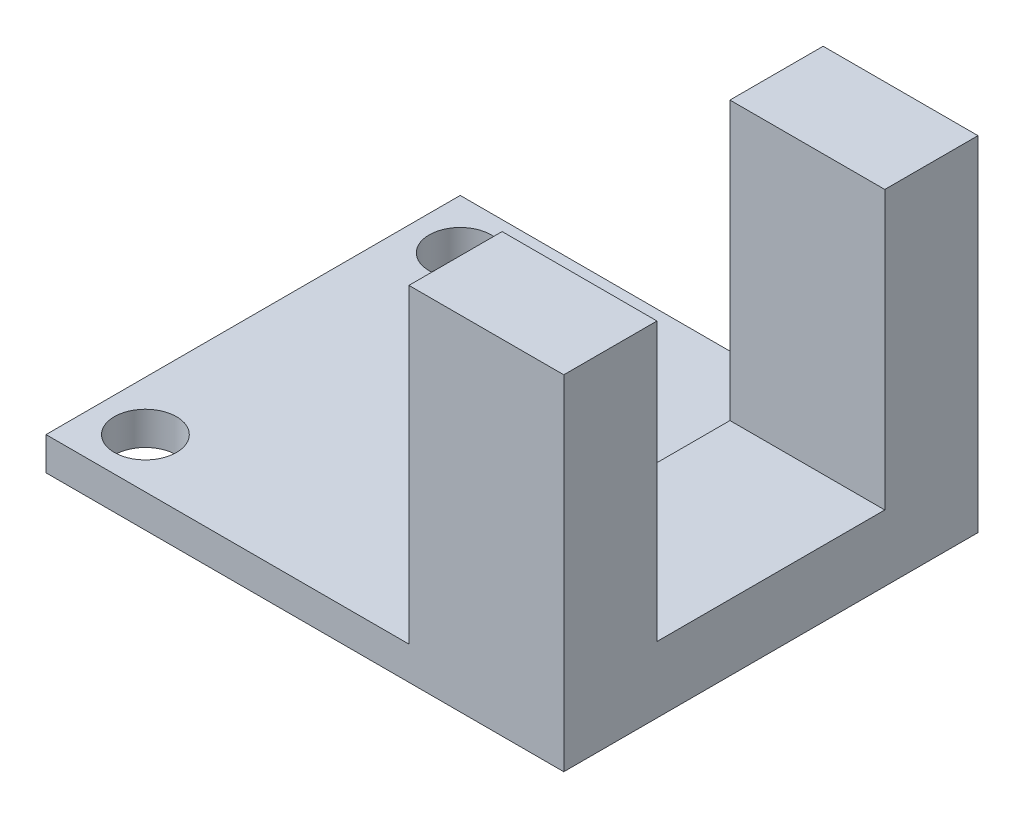
ISO-10303-21;
HEADER;
FILE_DESCRIPTION(('STEP AP214'),'2;1');
FILE_NAME('part.step','',(''),(''),'','','');
FILE_SCHEMA(('AUTOMOTIVE_DESIGN { 1 0 10303 214 1 1 1 1 }'));
ENDSEC;
DATA;
#1=APPLICATION_CONTEXT('core data for automotive mechanical design processes');
#2=APPLICATION_PROTOCOL_DEFINITION('international standard','automotive_design',2000,#1);
#3=PRODUCT_CONTEXT('',#1,'mechanical');
#4=PRODUCT('Part','Part','',(#3));
#5=PRODUCT_RELATED_PRODUCT_CATEGORY('part','',(#4));
#6=PRODUCT_DEFINITION_FORMATION('','',#4);
#7=PRODUCT_DEFINITION_CONTEXT('part definition',#1,'design');
#8=PRODUCT_DEFINITION('design','',#6,#7);
#9=PRODUCT_DEFINITION_SHAPE('','',#8);
#10=(LENGTH_UNIT() NAMED_UNIT(*) SI_UNIT(.MILLI.,.METRE.));
#11=(NAMED_UNIT(*) PLANE_ANGLE_UNIT() SI_UNIT($,.RADIAN.));
#12=(NAMED_UNIT(*) SI_UNIT($,.STERADIAN.) SOLID_ANGLE_UNIT());
#13=UNCERTAINTY_MEASURE_WITH_UNIT(LENGTH_MEASURE(1.E-05),#10,'distance_accuracy_value','');
#14=(GEOMETRIC_REPRESENTATION_CONTEXT(3) GLOBAL_UNCERTAINTY_ASSIGNED_CONTEXT((#13)) GLOBAL_UNIT_ASSIGNED_CONTEXT((#10,
#11,#12)) REPRESENTATION_CONTEXT('',''));
#15=CARTESIAN_POINT('',(0.,0.,0.));
#16=DIRECTION('',(0.,0.,1.));
#17=DIRECTION('',(1.,0.,0.));
#18=AXIS2_PLACEMENT_3D('',#15,#16,#17);
#19=CARTESIAN_POINT('',(0.,16.6,0.));
#20=DIRECTION('',(0.,-1.,0.));
#21=DIRECTION('',(0.,0.,-1.));
#22=AXIS2_PLACEMENT_3D('',#19,#20,#21);
#23=PLANE('',#22);
#24=DIRECTION('',(0.,0.,-1.));
#25=VECTOR('',#24,1.);
#26=CARTESIAN_POINT('',(12.5,16.6,-10.));
#27=LINE('',#26,#25);
#28=CARTESIAN_POINT('',(12.5,16.6,10.));
#29=VERTEX_POINT('',#28);
#30=CARTESIAN_POINT('',(12.5,16.6,5.5));
#31=VERTEX_POINT('',#30);
#32=EDGE_CURVE('E155',#29,#31,#27,.T.);
#33=ORIENTED_EDGE('',*,*,#32,.T.);
#34=DIRECTION('',(-1.,0.,0.));
#35=VECTOR('',#34,1.);
#36=CARTESIAN_POINT('',(0.,16.6,5.5));
#37=LINE('',#36,#35);
#38=CARTESIAN_POINT('',(5.02288268675244,16.6,5.5));
#39=VERTEX_POINT('',#38);
#40=EDGE_CURVE('E49',#31,#39,#37,.T.);
#41=ORIENTED_EDGE('',*,*,#40,.T.);
#42=DIRECTION('',(0.,0.,1.));
#43=VECTOR('',#42,1.);
#44=CARTESIAN_POINT('',(5.02288268675244,16.6,-10.));
#45=LINE('',#44,#43);
#46=CARTESIAN_POINT('',(5.02288268675244,16.6,10.));
#47=VERTEX_POINT('',#46);
#48=EDGE_CURVE('E162',#39,#47,#45,.T.);
#49=ORIENTED_EDGE('',*,*,#48,.T.);
#50=DIRECTION('',(1.,0.,0.));
#51=VECTOR('',#50,1.);
#52=CARTESIAN_POINT('',(12.5,16.6,10.));
#53=LINE('',#52,#51);
#54=EDGE_CURVE('E167',#47,#29,#53,.T.);
#55=ORIENTED_EDGE('',*,*,#54,.T.);
#56=EDGE_LOOP('',(#33,#41,#49,#55));
#57=FACE_BOUND('',#56,.T.);
#58=ADVANCED_FACE('F39',(#57),#23,.F.);
#59=CARTESIAN_POINT('',(12.5,1.6,-10.));
#60=DIRECTION('',(-1.,0.,0.));
#61=DIRECTION('',(0.,0.,1.));
#62=AXIS2_PLACEMENT_3D('',#59,#60,#61);
#63=PLANE('',#62);
#64=DIRECTION('',(0.,0.,-1.));
#65=VECTOR('',#64,1.);
#66=CARTESIAN_POINT('',(12.5,3.19763777042681,5.5));
#67=LINE('',#66,#65);
#68=CARTESIAN_POINT('',(12.5,3.19763777042681,5.5));
#69=VERTEX_POINT('',#68);
#70=CARTESIAN_POINT('',(12.5,3.19763777042681,-5.5));
#71=VERTEX_POINT('',#70);
#72=EDGE_CURVE('E124',#69,#71,#67,.T.);
#73=ORIENTED_EDGE('',*,*,#72,.F.);
#74=DIRECTION('',(0.,-1.,0.));
#75=VECTOR('',#74,1.);
#76=CARTESIAN_POINT('',(12.5,16.6,5.5));
#77=LINE('',#76,#75);
#78=EDGE_CURVE('E131',#31,#69,#77,.T.);
#79=ORIENTED_EDGE('',*,*,#78,.F.);
#80=ORIENTED_EDGE('',*,*,#32,.F.);
#81=DIRECTION('',(0.,-1.,0.));
#82=VECTOR('',#81,1.);
#83=CARTESIAN_POINT('',(12.5,1.6,10.));
#84=LINE('',#83,#82);
#85=CARTESIAN_POINT('',(12.5,0.,10.));
#86=VERTEX_POINT('',#85);
#87=EDGE_CURVE('E192',#29,#86,#84,.T.);
#88=ORIENTED_EDGE('',*,*,#87,.T.);
#89=DIRECTION('',(0.,0.,-1.));
#90=VECTOR('',#89,1.);
#91=CARTESIAN_POINT('',(12.5,0.,-10.));
#92=LINE('',#91,#90);
#93=CARTESIAN_POINT('',(12.5,0.,-10.));
#94=VERTEX_POINT('',#93);
#95=EDGE_CURVE('E181',#86,#94,#92,.T.);
#96=ORIENTED_EDGE('',*,*,#95,.T.);
#97=DIRECTION('',(0.,-1.,0.));
#98=VECTOR('',#97,1.);
#99=CARTESIAN_POINT('',(12.5,1.6,-10.));
#100=LINE('',#99,#98);
#101=CARTESIAN_POINT('',(12.5,16.6,-10.));
#102=VERTEX_POINT('',#101);
#103=EDGE_CURVE('E215',#102,#94,#100,.T.);
#104=ORIENTED_EDGE('',*,*,#103,.F.);
#105=CARTESIAN_POINT('',(12.5,16.6,-5.5));
#106=VERTEX_POINT('',#105);
#107=EDGE_CURVE('E159',#106,#102,#27,.T.);
#108=ORIENTED_EDGE('',*,*,#107,.F.);
#109=DIRECTION('',(0.,1.,0.));
#110=VECTOR('',#109,1.);
#111=CARTESIAN_POINT('',(12.5,16.6,-5.5));
#112=LINE('',#111,#110);
#113=EDGE_CURVE('E57',#71,#106,#112,.T.);
#114=ORIENTED_EDGE('',*,*,#113,.F.);
#115=EDGE_LOOP('',(#73,#79,#80,#88,#96,#104,#108,#114));
#116=FACE_BOUND('',#115,.T.);
#117=ADVANCED_FACE('F41',(#116),#63,.F.);
#118=CARTESIAN_POINT('',(-12.5,1.6,-10.));
#119=DIRECTION('',(0.,0.,1.));
#120=DIRECTION('',(1.,0.,0.));
#121=AXIS2_PLACEMENT_3D('',#118,#119,#120);
#122=PLANE('',#121);
#123=DIRECTION('',(-1.,0.,0.));
#124=VECTOR('',#123,1.);
#125=CARTESIAN_POINT('',(-12.5,0.,-10.));
#126=LINE('',#125,#124);
#127=CARTESIAN_POINT('',(-12.5,0.,-10.));
#128=VERTEX_POINT('',#127);
#129=EDGE_CURVE('E196',#94,#128,#126,.T.);
#130=ORIENTED_EDGE('',*,*,#129,.T.);
#131=DIRECTION('',(0.,-1.,0.));
#132=VECTOR('',#131,1.);
#133=CARTESIAN_POINT('',(-12.5,1.6,-10.));
#134=LINE('',#133,#132);
#135=CARTESIAN_POINT('',(-12.5,1.6,-10.));
#136=VERTEX_POINT('',#135);
#137=EDGE_CURVE('E211',#136,#128,#134,.T.);
#138=ORIENTED_EDGE('',*,*,#137,.F.);
#139=DIRECTION('',(-1.,0.,0.));
#140=VECTOR('',#139,1.);
#141=CARTESIAN_POINT('',(-12.5,1.6,-10.));
#142=LINE('',#141,#140);
#143=CARTESIAN_POINT('',(5.02288268675244,1.6,-10.));
#144=VERTEX_POINT('',#143);
#145=EDGE_CURVE('E182',#144,#136,#142,.T.);
#146=ORIENTED_EDGE('',*,*,#145,.F.);
#147=DIRECTION('',(0.,-1.,0.));
#148=VECTOR('',#147,1.);
#149=CARTESIAN_POINT('',(5.02288268675244,16.6,-10.));
#150=LINE('',#149,#148);
#151=CARTESIAN_POINT('',(5.02288268675244,16.6,-10.));
#152=VERTEX_POINT('',#151);
#153=EDGE_CURVE('E177',#152,#144,#150,.T.);
#154=ORIENTED_EDGE('',*,*,#153,.F.);
#155=DIRECTION('',(-1.,0.,0.));
#156=VECTOR('',#155,1.);
#157=CARTESIAN_POINT('',(12.5,16.6,-10.));
#158=LINE('',#157,#156);
#159=EDGE_CURVE('E158',#102,#152,#158,.T.);
#160=ORIENTED_EDGE('',*,*,#159,.F.);
#161=ORIENTED_EDGE('',*,*,#103,.T.);
#162=EDGE_LOOP('',(#130,#138,#146,#154,#160,#161));
#163=FACE_BOUND('',#162,.T.);
#164=ADVANCED_FACE('F268',(#163),#122,.F.);
#165=CARTESIAN_POINT('',(-12.5,1.6,-10.));
#166=DIRECTION('',(1.,0.,0.));
#167=DIRECTION('',(0.,0.,-1.));
#168=AXIS2_PLACEMENT_3D('',#165,#166,#167);
#169=PLANE('',#168);
#170=DIRECTION('',(0.,0.,1.));
#171=VECTOR('',#170,1.);
#172=CARTESIAN_POINT('',(-12.5,0.,-10.));
#173=LINE('',#172,#171);
#174=CARTESIAN_POINT('',(-12.5,0.,10.));
#175=VERTEX_POINT('',#174);
#176=EDGE_CURVE('E199',#128,#175,#173,.T.);
#177=ORIENTED_EDGE('',*,*,#176,.T.);
#178=DIRECTION('',(0.,-1.,0.));
#179=VECTOR('',#178,1.);
#180=CARTESIAN_POINT('',(-12.5,1.6,10.));
#181=LINE('',#180,#179);
#182=CARTESIAN_POINT('',(-12.5,1.6,10.));
#183=VERTEX_POINT('',#182);
#184=EDGE_CURVE('E207',#183,#175,#181,.T.);
#185=ORIENTED_EDGE('',*,*,#184,.F.);
#186=DIRECTION('',(0.,0.,1.));
#187=VECTOR('',#186,1.);
#188=CARTESIAN_POINT('',(-12.5,1.6,-10.));
#189=LINE('',#188,#187);
#190=EDGE_CURVE('E185',#136,#183,#189,.T.);
#191=ORIENTED_EDGE('',*,*,#190,.F.);
#192=ORIENTED_EDGE('',*,*,#137,.T.);
#193=EDGE_LOOP('',(#177,#185,#191,#192));
#194=FACE_BOUND('',#193,.T.);
#195=ADVANCED_FACE('F257',(#194),#169,.F.);
#196=CARTESIAN_POINT('',(-12.5,1.6,10.));
#197=DIRECTION('',(0.,0.,-1.));
#198=DIRECTION('',(-1.,0.,0.));
#199=AXIS2_PLACEMENT_3D('',#196,#197,#198);
#200=PLANE('',#199);
#201=DIRECTION('',(1.,0.,0.));
#202=VECTOR('',#201,1.);
#203=CARTESIAN_POINT('',(-12.5,0.,10.));
#204=LINE('',#203,#202);
#205=EDGE_CURVE('E186',#175,#86,#204,.T.);
#206=ORIENTED_EDGE('',*,*,#205,.T.);
#207=ORIENTED_EDGE('',*,*,#87,.F.);
#208=ORIENTED_EDGE('',*,*,#54,.F.);
#209=DIRECTION('',(0.,-1.,0.));
#210=VECTOR('',#209,1.);
#211=CARTESIAN_POINT('',(5.02288268675244,16.6,10.));
#212=LINE('',#211,#210);
#213=CARTESIAN_POINT('',(5.02288268675244,1.6,10.));
#214=VERTEX_POINT('',#213);
#215=EDGE_CURVE('E171',#47,#214,#212,.T.);
#216=ORIENTED_EDGE('',*,*,#215,.T.);
#217=DIRECTION('',(1.,0.,0.));
#218=VECTOR('',#217,1.);
#219=CARTESIAN_POINT('',(-12.5,1.6,10.));
#220=LINE('',#219,#218);
#221=EDGE_CURVE('E189',#183,#214,#220,.T.);
#222=ORIENTED_EDGE('',*,*,#221,.F.);
#223=ORIENTED_EDGE('',*,*,#184,.T.);
#224=EDGE_LOOP('',(#206,#207,#208,#216,#222,#223));
#225=FACE_BOUND('',#224,.T.);
#226=ADVANCED_FACE('F247',(#225),#200,.F.);
#227=CARTESIAN_POINT('',(0.,1.6,0.));
#228=DIRECTION('',(0.,1.,0.));
#229=DIRECTION('',(0.,0.,1.));
#230=AXIS2_PLACEMENT_3D('',#227,#228,#229);
#231=PLANE('',#230);
#232=CARTESIAN_POINT('',(-10.1,1.6,-7.6));
#233=DIRECTION('',(0.,1.,0.));
#234=DIRECTION('',(0.,0.,1.));
#235=AXIS2_PLACEMENT_3D('',#232,#233,#234);
#236=CIRCLE('',#235,1.5);
#237=CARTESIAN_POINT('',(-10.1,1.6,-6.1));
#238=VERTEX_POINT('',#237);
#239=EDGE_CURVE('E226',#238,#238,#236,.T.);
#240=ORIENTED_EDGE('',*,*,#239,.F.);
#241=EDGE_LOOP('',(#240));
#242=FACE_BOUND('',#241,.T.);
#243=CARTESIAN_POINT('',(-10.1,1.6,7.6));
#244=DIRECTION('',(0.,1.,0.));
#245=DIRECTION('',(0.,0.,1.));
#246=AXIS2_PLACEMENT_3D('',#243,#244,#245);
#247=CIRCLE('',#246,1.5);
#248=CARTESIAN_POINT('',(-10.1,1.6,9.1));
#249=VERTEX_POINT('',#248);
#250=EDGE_CURVE('E233',#249,#249,#247,.T.);
#251=ORIENTED_EDGE('',*,*,#250,.F.);
#252=EDGE_LOOP('',(#251));
#253=FACE_BOUND('',#252,.T.);
#254=DIRECTION('',(0.,0.,1.));
#255=VECTOR('',#254,1.);
#256=CARTESIAN_POINT('',(5.02288268675244,1.6,-10.));
#257=LINE('',#256,#255);
#258=EDGE_CURVE('E65',#144,#214,#257,.T.);
#259=ORIENTED_EDGE('',*,*,#258,.F.);
#260=ORIENTED_EDGE('',*,*,#145,.T.);
#261=ORIENTED_EDGE('',*,*,#190,.T.);
#262=ORIENTED_EDGE('',*,*,#221,.T.);
#263=EDGE_LOOP('',(#259,#260,#261,#262));
#264=FACE_BOUND('',#263,.T.);
#265=ADVANCED_FACE('F244',(#242,#253,#264),#231,.T.);
#266=CARTESIAN_POINT('',(0.,0.,0.));
#267=DIRECTION('',(0.,1.,0.));
#268=DIRECTION('',(0.,0.,1.));
#269=AXIS2_PLACEMENT_3D('',#266,#267,#268);
#270=PLANE('',#269);
#271=CARTESIAN_POINT('',(-10.1,0.,-7.6));
#272=DIRECTION('',(0.,1.,0.));
#273=DIRECTION('',(0.,0.,1.));
#274=AXIS2_PLACEMENT_3D('',#271,#272,#273);
#275=CIRCLE('',#274,1.5);
#276=CARTESIAN_POINT('',(-10.1,0.,-6.1));
#277=VERTEX_POINT('',#276);
#278=EDGE_CURVE('E43',#277,#277,#275,.T.);
#279=ORIENTED_EDGE('',*,*,#278,.T.);
#280=EDGE_LOOP('',(#279));
#281=FACE_BOUND('',#280,.T.);
#282=CARTESIAN_POINT('',(-10.1,0.,7.6));
#283=DIRECTION('',(0.,1.,0.));
#284=DIRECTION('',(0.,0.,1.));
#285=AXIS2_PLACEMENT_3D('',#282,#283,#284);
#286=CIRCLE('',#285,1.5);
#287=CARTESIAN_POINT('',(-10.1,0.,9.1));
#288=VERTEX_POINT('',#287);
#289=EDGE_CURVE('E223',#288,#288,#286,.T.);
#290=ORIENTED_EDGE('',*,*,#289,.T.);
#291=EDGE_LOOP('',(#290));
#292=FACE_BOUND('',#291,.T.);
#293=ORIENTED_EDGE('',*,*,#95,.F.);
#294=ORIENTED_EDGE('',*,*,#205,.F.);
#295=ORIENTED_EDGE('',*,*,#176,.F.);
#296=ORIENTED_EDGE('',*,*,#129,.F.);
#297=EDGE_LOOP('',(#293,#294,#295,#296));
#298=FACE_BOUND('',#297,.T.);
#299=ADVANCED_FACE('F246',(#281,#292,#298),#270,.F.);
#300=CARTESIAN_POINT('',(5.02288268675244,16.6,-10.));
#301=DIRECTION('',(1.,0.,0.));
#302=DIRECTION('',(0.,0.,-1.));
#303=AXIS2_PLACEMENT_3D('',#300,#301,#302);
#304=PLANE('',#303);
#305=ORIENTED_EDGE('',*,*,#48,.F.);
#306=DIRECTION('',(0.,-1.,0.));
#307=VECTOR('',#306,1.);
#308=CARTESIAN_POINT('',(5.02288268675244,16.6,5.5));
#309=LINE('',#308,#307);
#310=CARTESIAN_POINT('',(5.02288268675244,3.19763777042681,5.5));
#311=VERTEX_POINT('',#310);
#312=EDGE_CURVE('E152',#39,#311,#309,.T.);
#313=ORIENTED_EDGE('',*,*,#312,.T.);
#314=DIRECTION('',(0.,0.,-1.));
#315=VECTOR('',#314,1.);
#316=CARTESIAN_POINT('',(5.02288268675244,3.19763777042681,-10.));
#317=LINE('',#316,#315);
#318=CARTESIAN_POINT('',(5.02288268675244,3.19763777042681,-5.5));
#319=VERTEX_POINT('',#318);
#320=EDGE_CURVE('E11',#311,#319,#317,.T.);
#321=ORIENTED_EDGE('',*,*,#320,.T.);
#322=DIRECTION('',(0.,1.,0.));
#323=VECTOR('',#322,1.);
#324=CARTESIAN_POINT('',(5.02288268675244,16.6,-5.5));
#325=LINE('',#324,#323);
#326=CARTESIAN_POINT('',(5.02288268675244,16.6,-5.5));
#327=VERTEX_POINT('',#326);
#328=EDGE_CURVE('E147',#319,#327,#325,.T.);
#329=ORIENTED_EDGE('',*,*,#328,.T.);
#330=EDGE_CURVE('E163',#152,#327,#45,.T.);
#331=ORIENTED_EDGE('',*,*,#330,.F.);
#332=ORIENTED_EDGE('',*,*,#153,.T.);
#333=ORIENTED_EDGE('',*,*,#258,.T.);
#334=ORIENTED_EDGE('',*,*,#215,.F.);
#335=EDGE_LOOP('',(#305,#313,#321,#329,#331,#332,#333,#334));
#336=FACE_BOUND('',#335,.T.);
#337=ADVANCED_FACE('F254',(#336),#304,.F.);
#338=ORIENTED_EDGE('',*,*,#330,.T.);
#339=DIRECTION('',(1.,0.,0.));
#340=VECTOR('',#339,1.);
#341=CARTESIAN_POINT('',(0.,16.6,-5.5));
#342=LINE('',#341,#340);
#343=EDGE_CURVE('E219',#327,#106,#342,.T.);
#344=ORIENTED_EDGE('',*,*,#343,.T.);
#345=ORIENTED_EDGE('',*,*,#107,.T.);
#346=ORIENTED_EDGE('',*,*,#159,.T.);
#347=EDGE_LOOP('',(#338,#344,#345,#346));
#348=FACE_BOUND('',#347,.T.);
#349=ADVANCED_FACE('F264',(#348),#23,.F.);
#350=CARTESIAN_POINT('',(-2.5,3.19763777042681,5.5));
#351=DIRECTION('',(0.,-1.,0.));
#352=DIRECTION('',(0.,0.,-1.));
#353=AXIS2_PLACEMENT_3D('',#350,#351,#352);
#354=PLANE('',#353);
#355=DIRECTION('',(1.,0.,0.));
#356=VECTOR('',#355,1.);
#357=CARTESIAN_POINT('',(-2.5,3.19763777042681,5.5));
#358=LINE('',#357,#356);
#359=EDGE_CURVE('E119',#311,#69,#358,.T.);
#360=ORIENTED_EDGE('',*,*,#359,.T.);
#361=ORIENTED_EDGE('',*,*,#72,.T.);
#362=DIRECTION('',(1.,0.,0.));
#363=VECTOR('',#362,1.);
#364=CARTESIAN_POINT('',(-2.5,3.19763777042681,-5.5));
#365=LINE('',#364,#363);
#366=EDGE_CURVE('E128',#319,#71,#365,.T.);
#367=ORIENTED_EDGE('',*,*,#366,.F.);
#368=ORIENTED_EDGE('',*,*,#320,.F.);
#369=EDGE_LOOP('',(#360,#361,#367,#368));
#370=FACE_BOUND('',#369,.T.);
#371=ADVANCED_FACE('F121',(#370),#354,.F.);
#372=CARTESIAN_POINT('',(-2.5,16.6,5.5));
#373=DIRECTION('',(0.,0.,1.));
#374=DIRECTION('',(1.,0.,0.));
#375=AXIS2_PLACEMENT_3D('',#372,#373,#374);
#376=PLANE('',#375);
#377=ORIENTED_EDGE('',*,*,#40,.F.);
#378=ORIENTED_EDGE('',*,*,#78,.T.);
#379=ORIENTED_EDGE('',*,*,#359,.F.);
#380=ORIENTED_EDGE('',*,*,#312,.F.);
#381=EDGE_LOOP('',(#377,#378,#379,#380));
#382=FACE_BOUND('',#381,.T.);
#383=ADVANCED_FACE('F132',(#382),#376,.F.);
#384=CARTESIAN_POINT('',(-2.5,16.6,-5.5));
#385=DIRECTION('',(0.,0.,-1.));
#386=DIRECTION('',(-1.,0.,0.));
#387=AXIS2_PLACEMENT_3D('',#384,#385,#386);
#388=PLANE('',#387);
#389=ORIENTED_EDGE('',*,*,#366,.T.);
#390=ORIENTED_EDGE('',*,*,#113,.T.);
#391=ORIENTED_EDGE('',*,*,#343,.F.);
#392=ORIENTED_EDGE('',*,*,#328,.F.);
#393=EDGE_LOOP('',(#389,#390,#391,#392));
#394=FACE_BOUND('',#393,.T.);
#395=ADVANCED_FACE('F282',(#394),#388,.F.);
#396=CARTESIAN_POINT('',(-10.1,-13.4,7.6));
#397=DIRECTION('',(0.,1.,0.));
#398=DIRECTION('',(0.,0.,1.));
#399=AXIS2_PLACEMENT_3D('',#396,#397,#398);
#400=CYLINDRICAL_SURFACE('',#399,1.5);
#401=ORIENTED_EDGE('',*,*,#250,.T.);
#402=EDGE_LOOP('',(#401));
#403=FACE_BOUND('',#402,.T.);
#404=ORIENTED_EDGE('',*,*,#289,.F.);
#405=EDGE_LOOP('',(#404));
#406=FACE_BOUND('',#405,.T.);
#407=ADVANCED_FACE('F241',(#403,#406),#400,.F.);
#408=CARTESIAN_POINT('',(-10.1,-13.4,-7.6));
#409=DIRECTION('',(0.,1.,0.));
#410=DIRECTION('',(0.,0.,1.));
#411=AXIS2_PLACEMENT_3D('',#408,#409,#410);
#412=CYLINDRICAL_SURFACE('',#411,1.5);
#413=ORIENTED_EDGE('',*,*,#239,.T.);
#414=EDGE_LOOP('',(#413));
#415=FACE_BOUND('',#414,.T.);
#416=ORIENTED_EDGE('',*,*,#278,.F.);
#417=EDGE_LOOP('',(#416));
#418=FACE_BOUND('',#417,.T.);
#419=ADVANCED_FACE('F289',(#415,#418),#412,.F.);
#420=CLOSED_SHELL('',(#58,#117,#164,#195,#226,#265,#299,#337,#349,#371,#383,#395,#407,#419));
#421=MANIFOLD_SOLID_BREP('B2',#420);
#422=ADVANCED_BREP_SHAPE_REPRESENTATION('',(#18,#421),#14);
#423=SHAPE_DEFINITION_REPRESENTATION(#9,#422);
ENDSEC;
END-ISO-10303-21;
